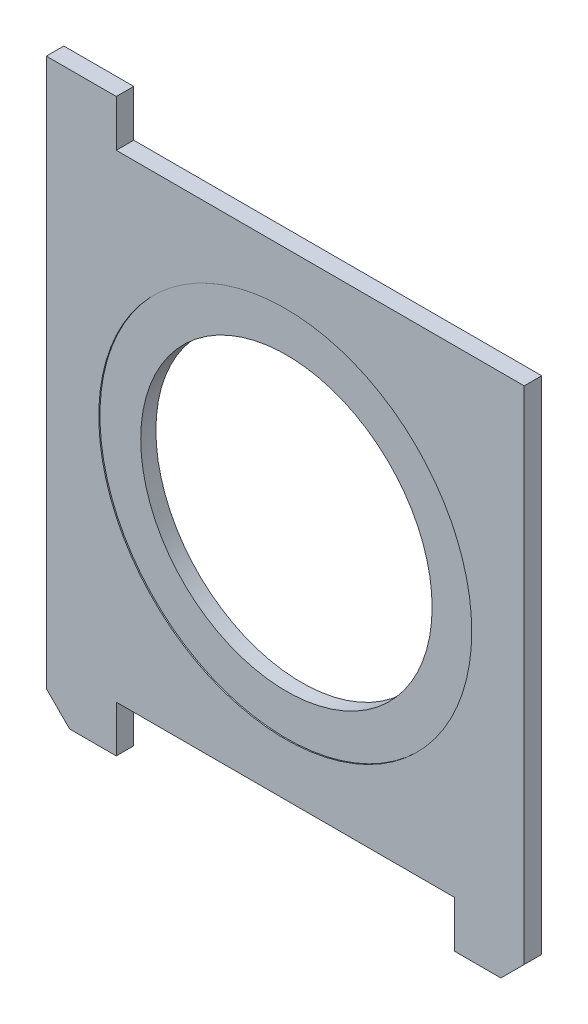
ISO-10303-21;
HEADER;
FILE_DESCRIPTION(('STEP AP214'),'2;1');
FILE_NAME('part.step','',(''),(''),'','','');
FILE_SCHEMA(('AUTOMOTIVE_DESIGN { 1 0 10303 214 1 1 1 1 }'));
ENDSEC;
DATA;
#1=APPLICATION_CONTEXT('core data for automotive mechanical design processes');
#2=APPLICATION_PROTOCOL_DEFINITION('international standard','automotive_design',2000,#1);
#3=PRODUCT_CONTEXT('',#1,'mechanical');
#4=PRODUCT('Part','Part','',(#3));
#5=PRODUCT_RELATED_PRODUCT_CATEGORY('part','',(#4));
#6=PRODUCT_DEFINITION_FORMATION('','',#4);
#7=PRODUCT_DEFINITION_CONTEXT('part definition',#1,'design');
#8=PRODUCT_DEFINITION('design','',#6,#7);
#9=PRODUCT_DEFINITION_SHAPE('','',#8);
#10=(LENGTH_UNIT() NAMED_UNIT(*) SI_UNIT(.MILLI.,.METRE.));
#11=(NAMED_UNIT(*) PLANE_ANGLE_UNIT() SI_UNIT($,.RADIAN.));
#12=(NAMED_UNIT(*) SI_UNIT($,.STERADIAN.) SOLID_ANGLE_UNIT());
#13=UNCERTAINTY_MEASURE_WITH_UNIT(LENGTH_MEASURE(1.E-05),#10,'distance_accuracy_value','');
#14=(GEOMETRIC_REPRESENTATION_CONTEXT(3) GLOBAL_UNCERTAINTY_ASSIGNED_CONTEXT((#13)) GLOBAL_UNIT_ASSIGNED_CONTEXT((#10,
#11,#12)) REPRESENTATION_CONTEXT('',''));
#15=CARTESIAN_POINT('',(0.,0.,0.));
#16=DIRECTION('',(0.,0.,1.));
#17=DIRECTION('',(1.,0.,0.));
#18=AXIS2_PLACEMENT_3D('',#15,#16,#17);
#19=CARTESIAN_POINT('',(0.,0.,1.5));
#20=DIRECTION('',(0.,0.,-1.));
#21=DIRECTION('',(-1.,0.,0.));
#22=AXIS2_PLACEMENT_3D('',#19,#20,#21);
#23=CYLINDRICAL_SURFACE('',#22,12.5);
#24=CARTESIAN_POINT('',(0.,0.,0.1));
#25=DIRECTION('',(0.,0.,-1.));
#26=DIRECTION('',(-1.,0.,0.));
#27=AXIS2_PLACEMENT_3D('',#24,#25,#26);
#28=CIRCLE('',#27,12.5);
#29=CARTESIAN_POINT('',(-12.5,0.,0.1));
#30=VERTEX_POINT('',#29);
#31=EDGE_CURVE('E151',#30,#30,#28,.F.);
#32=ORIENTED_EDGE('',*,*,#31,.F.);
#33=EDGE_LOOP('',(#32));
#34=FACE_BOUND('',#33,.T.);
#35=CARTESIAN_POINT('',(0.,0.,1.4));
#36=DIRECTION('',(0.,0.,1.));
#37=DIRECTION('',(1.,0.,0.));
#38=AXIS2_PLACEMENT_3D('',#35,#36,#37);
#39=CIRCLE('',#38,12.5);
#40=CARTESIAN_POINT('',(12.5,0.,1.4));
#41=VERTEX_POINT('',#40);
#42=EDGE_CURVE('E212',#41,#41,#39,.F.);
#43=ORIENTED_EDGE('',*,*,#42,.F.);
#44=EDGE_LOOP('',(#43));
#45=FACE_BOUND('',#44,.T.);
#46=ADVANCED_FACE('F36',(#34,#45),#23,.F.);
#47=CARTESIAN_POINT('',(-20.5,-20.5,1.5));
#48=DIRECTION('',(0.,1.,0.));
#49=DIRECTION('',(0.,0.,1.));
#50=AXIS2_PLACEMENT_3D('',#47,#48,#49);
#51=PLANE('',#50);
#52=DIRECTION('',(1.,0.,0.));
#53=VECTOR('',#52,1.);
#54=CARTESIAN_POINT('',(-20.5,-20.5,1.5));
#55=LINE('',#54,#53);
#56=CARTESIAN_POINT('',(-14.5,-20.5,1.5));
#57=VERTEX_POINT('',#56);
#58=CARTESIAN_POINT('',(14.5,-20.5,1.5));
#59=VERTEX_POINT('',#58);
#60=EDGE_CURVE('E142',#57,#59,#55,.T.);
#61=ORIENTED_EDGE('',*,*,#60,.F.);
#62=DIRECTION('',(0.,0.,-1.));
#63=VECTOR('',#62,1.);
#64=CARTESIAN_POINT('',(-14.5,-20.5,8.71110255092798));
#65=LINE('',#64,#63);
#66=CARTESIAN_POINT('',(-14.5,-20.5,0.));
#67=VERTEX_POINT('',#66);
#68=EDGE_CURVE('E140',#57,#67,#65,.T.);
#69=ORIENTED_EDGE('',*,*,#68,.T.);
#70=DIRECTION('',(1.,0.,0.));
#71=VECTOR('',#70,1.);
#72=CARTESIAN_POINT('',(-20.5,-20.5,0.));
#73=LINE('',#72,#71);
#74=CARTESIAN_POINT('',(14.5,-20.5,0.));
#75=VERTEX_POINT('',#74);
#76=EDGE_CURVE('E124',#67,#75,#73,.T.);
#77=ORIENTED_EDGE('',*,*,#76,.T.);
#78=DIRECTION('',(0.,0.,-1.));
#79=VECTOR('',#78,1.);
#80=CARTESIAN_POINT('',(14.5,-20.5,8.71110255092798));
#81=LINE('',#80,#79);
#82=EDGE_CURVE('E166',#59,#75,#81,.T.);
#83=ORIENTED_EDGE('',*,*,#82,.F.);
#84=EDGE_LOOP('',(#61,#69,#77,#83));
#85=FACE_BOUND('',#84,.T.);
#86=ADVANCED_FACE('F141',(#85),#51,.F.);
#87=CARTESIAN_POINT('',(-20.5,20.5,1.5));
#88=DIRECTION('',(0.,-1.,0.));
#89=DIRECTION('',(0.,0.,-1.));
#90=AXIS2_PLACEMENT_3D('',#87,#88,#89);
#91=PLANE('',#90);
#92=DIRECTION('',(0.,0.,-1.));
#93=VECTOR('',#92,1.);
#94=CARTESIAN_POINT('',(-14.5,20.5,8.71110255092798));
#95=LINE('',#94,#93);
#96=CARTESIAN_POINT('',(-14.5,20.5,1.5));
#97=VERTEX_POINT('',#96);
#98=CARTESIAN_POINT('',(-14.5,20.5,0.));
#99=VERTEX_POINT('',#98);
#100=EDGE_CURVE('E179',#97,#99,#95,.T.);
#101=ORIENTED_EDGE('',*,*,#100,.F.);
#102=DIRECTION('',(-1.,0.,0.));
#103=VECTOR('',#102,1.);
#104=CARTESIAN_POINT('',(-20.5,20.5,1.5));
#105=LINE('',#104,#103);
#106=CARTESIAN_POINT('',(20.5,20.5,1.5));
#107=VERTEX_POINT('',#106);
#108=EDGE_CURVE('E196',#107,#97,#105,.T.);
#109=ORIENTED_EDGE('',*,*,#108,.F.);
#110=DIRECTION('',(0.,0.,-1.));
#111=VECTOR('',#110,1.);
#112=CARTESIAN_POINT('',(20.5,20.5,1.5));
#113=LINE('',#112,#111);
#114=CARTESIAN_POINT('',(20.5,20.5,0.));
#115=VERTEX_POINT('',#114);
#116=EDGE_CURVE('E203',#107,#115,#113,.T.);
#117=ORIENTED_EDGE('',*,*,#116,.T.);
#118=DIRECTION('',(-1.,0.,0.));
#119=VECTOR('',#118,1.);
#120=CARTESIAN_POINT('',(-20.5,20.5,0.));
#121=LINE('',#120,#119);
#122=EDGE_CURVE('E205',#115,#99,#121,.T.);
#123=ORIENTED_EDGE('',*,*,#122,.T.);
#124=EDGE_LOOP('',(#101,#109,#117,#123));
#125=FACE_BOUND('',#124,.T.);
#126=ADVANCED_FACE('F239',(#125),#91,.F.);
#127=CARTESIAN_POINT('',(20.5,-20.5,1.5));
#128=DIRECTION('',(-1.,0.,0.));
#129=DIRECTION('',(0.,0.,1.));
#130=AXIS2_PLACEMENT_3D('',#127,#128,#129);
#131=PLANE('',#130);
#132=DIRECTION('',(0.,1.,0.));
#133=VECTOR('',#132,1.);
#134=CARTESIAN_POINT('',(20.5,-20.5,1.5));
#135=LINE('',#134,#133);
#136=CARTESIAN_POINT('',(20.5,-22.5,1.5));
#137=VERTEX_POINT('',#136);
#138=EDGE_CURVE('E136',#137,#107,#135,.T.);
#139=ORIENTED_EDGE('',*,*,#138,.F.);
#140=DIRECTION('',(0.,0.,-1.));
#141=VECTOR('',#140,1.);
#142=CARTESIAN_POINT('',(20.5,-22.5,0.));
#143=LINE('',#142,#141);
#144=CARTESIAN_POINT('',(20.5,-22.5,0.));
#145=VERTEX_POINT('',#144);
#146=EDGE_CURVE('E225',#137,#145,#143,.T.);
#147=ORIENTED_EDGE('',*,*,#146,.T.);
#148=DIRECTION('',(0.,1.,0.));
#149=VECTOR('',#148,1.);
#150=CARTESIAN_POINT('',(20.5,-20.5,0.));
#151=LINE('',#150,#149);
#152=EDGE_CURVE('E194',#145,#115,#151,.T.);
#153=ORIENTED_EDGE('',*,*,#152,.T.);
#154=ORIENTED_EDGE('',*,*,#116,.F.);
#155=EDGE_LOOP('',(#139,#147,#153,#154));
#156=FACE_BOUND('',#155,.T.);
#157=ADVANCED_FACE('F231',(#156),#131,.F.);
#158=CARTESIAN_POINT('',(-20.5,-20.5,1.5));
#159=DIRECTION('',(1.,0.,0.));
#160=DIRECTION('',(0.,0.,-1.));
#161=AXIS2_PLACEMENT_3D('',#158,#159,#160);
#162=PLANE('',#161);
#163=DIRECTION('',(0.,-1.,0.));
#164=VECTOR('',#163,1.);
#165=CARTESIAN_POINT('',(-20.5,-20.5,0.));
#166=LINE('',#165,#164);
#167=CARTESIAN_POINT('',(-20.5,24.5,0.));
#168=VERTEX_POINT('',#167);
#169=CARTESIAN_POINT('',(-20.5,-22.5,0.));
#170=VERTEX_POINT('',#169);
#171=EDGE_CURVE('E137',#168,#170,#166,.T.);
#172=ORIENTED_EDGE('',*,*,#171,.T.);
#173=DIRECTION('',(0.,0.,1.));
#174=VECTOR('',#173,1.);
#175=CARTESIAN_POINT('',(-20.5,-22.5,1.5));
#176=LINE('',#175,#174);
#177=CARTESIAN_POINT('',(-20.5,-22.5,1.5));
#178=VERTEX_POINT('',#177);
#179=EDGE_CURVE('E221',#170,#178,#176,.T.);
#180=ORIENTED_EDGE('',*,*,#179,.T.);
#181=DIRECTION('',(0.,-1.,0.));
#182=VECTOR('',#181,1.);
#183=CARTESIAN_POINT('',(-20.5,-20.5,1.5));
#184=LINE('',#183,#182);
#185=CARTESIAN_POINT('',(-20.5,24.5,1.5));
#186=VERTEX_POINT('',#185);
#187=EDGE_CURVE('E199',#186,#178,#184,.T.);
#188=ORIENTED_EDGE('',*,*,#187,.F.);
#189=DIRECTION('',(0.,0.,-1.));
#190=VECTOR('',#189,1.);
#191=CARTESIAN_POINT('',(-20.5,24.5,8.71110255092798));
#192=LINE('',#191,#190);
#193=EDGE_CURVE('E185',#186,#168,#192,.T.);
#194=ORIENTED_EDGE('',*,*,#193,.T.);
#195=EDGE_LOOP('',(#172,#180,#188,#194));
#196=FACE_BOUND('',#195,.T.);
#197=ADVANCED_FACE('F260',(#196),#162,.F.);
#198=CARTESIAN_POINT('',(0.,0.,1.5));
#199=DIRECTION('',(0.,0.,-1.));
#200=DIRECTION('',(-1.,0.,0.));
#201=AXIS2_PLACEMENT_3D('',#198,#199,#200);
#202=PLANE('',#201);
#203=CARTESIAN_POINT('',(0.,0.,1.5));
#204=DIRECTION('',(0.,0.,1.));
#205=DIRECTION('',(1.,0.,0.));
#206=AXIS2_PLACEMENT_3D('',#203,#204,#205);
#207=CIRCLE('',#206,16.);
#208=CARTESIAN_POINT('',(16.,0.,1.5));
#209=VERTEX_POINT('',#208);
#210=EDGE_CURVE('E485',#209,#209,#207,.T.);
#211=ORIENTED_EDGE('',*,*,#210,.F.);
#212=EDGE_LOOP('',(#211));
#213=FACE_BOUND('',#212,.T.);
#214=DIRECTION('',(1.,0.,0.));
#215=VECTOR('',#214,1.);
#216=CARTESIAN_POINT('',(20.5,-24.5,1.5));
#217=LINE('',#216,#215);
#218=CARTESIAN_POINT('',(14.5,-24.5,1.5));
#219=VERTEX_POINT('',#218);
#220=CARTESIAN_POINT('',(18.5,-24.5,1.5));
#221=VERTEX_POINT('',#220);
#222=EDGE_CURVE('E165',#219,#221,#217,.T.);
#223=ORIENTED_EDGE('',*,*,#222,.T.);
#224=DIRECTION('',(0.707106781186549,0.707106781186546,0.));
#225=VECTOR('',#224,1.);
#226=CARTESIAN_POINT('',(20.5,-22.5,1.5));
#227=LINE('',#226,#225);
#228=EDGE_CURVE('E11',#221,#137,#227,.T.);
#229=ORIENTED_EDGE('',*,*,#228,.T.);
#230=ORIENTED_EDGE('',*,*,#138,.T.);
#231=ORIENTED_EDGE('',*,*,#108,.T.);
#232=DIRECTION('',(0.,1.,0.));
#233=VECTOR('',#232,1.);
#234=CARTESIAN_POINT('',(-14.5,20.5,1.5));
#235=LINE('',#234,#233);
#236=CARTESIAN_POINT('',(-14.5,24.5,1.5));
#237=VERTEX_POINT('',#236);
#238=EDGE_CURVE('E176',#97,#237,#235,.T.);
#239=ORIENTED_EDGE('',*,*,#238,.T.);
#240=DIRECTION('',(-1.,0.,0.));
#241=VECTOR('',#240,1.);
#242=CARTESIAN_POINT('',(-20.5,24.5,1.5));
#243=LINE('',#242,#241);
#244=EDGE_CURVE('E178',#237,#186,#243,.T.);
#245=ORIENTED_EDGE('',*,*,#244,.T.);
#246=ORIENTED_EDGE('',*,*,#187,.T.);
#247=DIRECTION('',(0.707106781186546,-0.707106781186549,0.));
#248=VECTOR('',#247,1.);
#249=CARTESIAN_POINT('',(-18.5,-24.5,1.5));
#250=LINE('',#249,#248);
#251=CARTESIAN_POINT('',(-18.5,-24.5,1.5));
#252=VERTEX_POINT('',#251);
#253=EDGE_CURVE('E223',#178,#252,#250,.T.);
#254=ORIENTED_EDGE('',*,*,#253,.T.);
#255=DIRECTION('',(1.,0.,0.));
#256=VECTOR('',#255,1.);
#257=CARTESIAN_POINT('',(-20.5,-24.5,1.5));
#258=LINE('',#257,#256);
#259=CARTESIAN_POINT('',(-14.5,-24.5,1.5));
#260=VERTEX_POINT('',#259);
#261=EDGE_CURVE('E158',#252,#260,#258,.T.);
#262=ORIENTED_EDGE('',*,*,#261,.T.);
#263=DIRECTION('',(0.,1.,0.));
#264=VECTOR('',#263,1.);
#265=CARTESIAN_POINT('',(-14.5,-20.5,1.5));
#266=LINE('',#265,#264);
#267=EDGE_CURVE('E161',#260,#57,#266,.T.);
#268=ORIENTED_EDGE('',*,*,#267,.T.);
#269=ORIENTED_EDGE('',*,*,#60,.T.);
#270=DIRECTION('',(0.,-1.,0.));
#271=VECTOR('',#270,1.);
#272=CARTESIAN_POINT('',(14.5,-20.5,1.5));
#273=LINE('',#272,#271);
#274=EDGE_CURVE('E163',#59,#219,#273,.T.);
#275=ORIENTED_EDGE('',*,*,#274,.T.);
#276=EDGE_LOOP('',(#223,#229,#230,#231,#239,#245,#246,#254,#262,#268,#269,#275));
#277=FACE_BOUND('',#276,.T.);
#278=ADVANCED_FACE('F242',(#213,#277),#202,.F.);
#279=CARTESIAN_POINT('',(0.,0.,0.));
#280=DIRECTION('',(0.,0.,-1.));
#281=DIRECTION('',(-1.,0.,0.));
#282=AXIS2_PLACEMENT_3D('',#279,#280,#281);
#283=PLANE('',#282);
#284=CARTESIAN_POINT('',(0.,0.,0.));
#285=DIRECTION('',(0.,0.,-1.));
#286=DIRECTION('',(-1.,0.,0.));
#287=AXIS2_PLACEMENT_3D('',#284,#285,#286);
#288=CIRCLE('',#287,16.);
#289=CARTESIAN_POINT('',(-16.,0.,0.));
#290=VERTEX_POINT('',#289);
#291=EDGE_CURVE('E215',#290,#290,#288,.T.);
#292=ORIENTED_EDGE('',*,*,#291,.F.);
#293=EDGE_LOOP('',(#292));
#294=FACE_BOUND('',#293,.T.);
#295=ORIENTED_EDGE('',*,*,#152,.F.);
#296=DIRECTION('',(-0.707106781186549,-0.707106781186546,0.));
#297=VECTOR('',#296,1.);
#298=CARTESIAN_POINT('',(21.5,-21.5,0.));
#299=LINE('',#298,#297);
#300=CARTESIAN_POINT('',(18.5,-24.5,0.));
#301=VERTEX_POINT('',#300);
#302=EDGE_CURVE('E59',#145,#301,#299,.T.);
#303=ORIENTED_EDGE('',*,*,#302,.T.);
#304=DIRECTION('',(-1.,0.,0.));
#305=VECTOR('',#304,1.);
#306=CARTESIAN_POINT('',(20.5,-24.5,0.));
#307=LINE('',#306,#305);
#308=CARTESIAN_POINT('',(14.5,-24.5,0.));
#309=VERTEX_POINT('',#308);
#310=EDGE_CURVE('E167',#301,#309,#307,.T.);
#311=ORIENTED_EDGE('',*,*,#310,.T.);
#312=DIRECTION('',(0.,1.,0.));
#313=VECTOR('',#312,1.);
#314=CARTESIAN_POINT('',(14.5,-20.5,0.));
#315=LINE('',#314,#313);
#316=EDGE_CURVE('E132',#309,#75,#315,.T.);
#317=ORIENTED_EDGE('',*,*,#316,.T.);
#318=ORIENTED_EDGE('',*,*,#76,.F.);
#319=DIRECTION('',(0.,-1.,0.));
#320=VECTOR('',#319,1.);
#321=CARTESIAN_POINT('',(-14.5,-20.5,0.));
#322=LINE('',#321,#320);
#323=CARTESIAN_POINT('',(-14.5,-24.5,0.));
#324=VERTEX_POINT('',#323);
#325=EDGE_CURVE('E129',#67,#324,#322,.T.);
#326=ORIENTED_EDGE('',*,*,#325,.T.);
#327=DIRECTION('',(-1.,0.,0.));
#328=VECTOR('',#327,1.);
#329=CARTESIAN_POINT('',(-20.5,-24.5,0.));
#330=LINE('',#329,#328);
#331=CARTESIAN_POINT('',(-18.5,-24.5,0.));
#332=VERTEX_POINT('',#331);
#333=EDGE_CURVE('E147',#324,#332,#330,.T.);
#334=ORIENTED_EDGE('',*,*,#333,.T.);
#335=DIRECTION('',(-0.707106781186546,0.707106781186549,0.));
#336=VECTOR('',#335,1.);
#337=CARTESIAN_POINT('',(-21.5,-21.5,0.));
#338=LINE('',#337,#336);
#339=EDGE_CURVE('E219',#332,#170,#338,.T.);
#340=ORIENTED_EDGE('',*,*,#339,.T.);
#341=ORIENTED_EDGE('',*,*,#171,.F.);
#342=DIRECTION('',(1.,0.,0.));
#343=VECTOR('',#342,1.);
#344=CARTESIAN_POINT('',(-20.5,24.5,0.));
#345=LINE('',#344,#343);
#346=CARTESIAN_POINT('',(-14.5,24.5,0.));
#347=VERTEX_POINT('',#346);
#348=EDGE_CURVE('E175',#168,#347,#345,.T.);
#349=ORIENTED_EDGE('',*,*,#348,.T.);
#350=DIRECTION('',(0.,-1.,0.));
#351=VECTOR('',#350,1.);
#352=CARTESIAN_POINT('',(-14.5,20.5,0.));
#353=LINE('',#352,#351);
#354=EDGE_CURVE('E182',#347,#99,#353,.T.);
#355=ORIENTED_EDGE('',*,*,#354,.T.);
#356=ORIENTED_EDGE('',*,*,#122,.F.);
#357=EDGE_LOOP('',(#295,#303,#311,#317,#318,#326,#334,#340,#341,#349,#355,#356));
#358=FACE_BOUND('',#357,.T.);
#359=ADVANCED_FACE('F126',(#294,#358),#283,.T.);
#360=CARTESIAN_POINT('',(-14.5,20.5,8.71110255092798));
#361=DIRECTION('',(1.,0.,0.));
#362=DIRECTION('',(0.,1.,0.));
#363=AXIS2_PLACEMENT_3D('',#360,#361,#362);
#364=PLANE('',#363);
#365=ORIENTED_EDGE('',*,*,#238,.F.);
#366=ORIENTED_EDGE('',*,*,#100,.T.);
#367=ORIENTED_EDGE('',*,*,#354,.F.);
#368=DIRECTION('',(0.,0.,-1.));
#369=VECTOR('',#368,1.);
#370=CARTESIAN_POINT('',(-14.5,24.5,8.71110255092798));
#371=LINE('',#370,#369);
#372=EDGE_CURVE('E188',#237,#347,#371,.T.);
#373=ORIENTED_EDGE('',*,*,#372,.F.);
#374=EDGE_LOOP('',(#365,#366,#367,#373));
#375=FACE_BOUND('',#374,.T.);
#376=ADVANCED_FACE('F245',(#375),#364,.T.);
#377=CARTESIAN_POINT('',(-20.5,24.5,8.71110255092798));
#378=DIRECTION('',(0.,1.,0.));
#379=DIRECTION('',(0.,0.,1.));
#380=AXIS2_PLACEMENT_3D('',#377,#378,#379);
#381=PLANE('',#380);
#382=ORIENTED_EDGE('',*,*,#244,.F.);
#383=ORIENTED_EDGE('',*,*,#372,.T.);
#384=ORIENTED_EDGE('',*,*,#348,.F.);
#385=ORIENTED_EDGE('',*,*,#193,.F.);
#386=EDGE_LOOP('',(#382,#383,#384,#385));
#387=FACE_BOUND('',#386,.T.);
#388=ADVANCED_FACE('F250',(#387),#381,.T.);
#389=CARTESIAN_POINT('',(14.5,-20.5,8.71110255092798));
#390=DIRECTION('',(-1.,0.,0.));
#391=DIRECTION('',(0.,-1.,0.));
#392=AXIS2_PLACEMENT_3D('',#389,#390,#391);
#393=PLANE('',#392);
#394=ORIENTED_EDGE('',*,*,#274,.F.);
#395=ORIENTED_EDGE('',*,*,#82,.T.);
#396=ORIENTED_EDGE('',*,*,#316,.F.);
#397=DIRECTION('',(0.,0.,-1.));
#398=VECTOR('',#397,1.);
#399=CARTESIAN_POINT('',(14.5,-24.5,8.71110255092798));
#400=LINE('',#399,#398);
#401=EDGE_CURVE('E170',#219,#309,#400,.T.);
#402=ORIENTED_EDGE('',*,*,#401,.F.);
#403=EDGE_LOOP('',(#394,#395,#396,#402));
#404=FACE_BOUND('',#403,.T.);
#405=ADVANCED_FACE('F290',(#404),#393,.T.);
#406=CARTESIAN_POINT('',(20.5,-24.5,8.71110255092798));
#407=DIRECTION('',(0.,-1.,0.));
#408=DIRECTION('',(0.,0.,-1.));
#409=AXIS2_PLACEMENT_3D('',#406,#407,#408);
#410=PLANE('',#409);
#411=ORIENTED_EDGE('',*,*,#310,.F.);
#412=DIRECTION('',(0.,0.,1.));
#413=VECTOR('',#412,1.);
#414=CARTESIAN_POINT('',(18.5,-24.5,1.5));
#415=LINE('',#414,#413);
#416=EDGE_CURVE('E45',#301,#221,#415,.T.);
#417=ORIENTED_EDGE('',*,*,#416,.T.);
#418=ORIENTED_EDGE('',*,*,#222,.F.);
#419=ORIENTED_EDGE('',*,*,#401,.T.);
#420=EDGE_LOOP('',(#411,#417,#418,#419));
#421=FACE_BOUND('',#420,.T.);
#422=ADVANCED_FACE('F286',(#421),#410,.T.);
#423=CARTESIAN_POINT('',(-20.5,-24.5,8.71110255092798));
#424=DIRECTION('',(0.,-1.,0.));
#425=DIRECTION('',(0.,0.,-1.));
#426=AXIS2_PLACEMENT_3D('',#423,#424,#425);
#427=PLANE('',#426);
#428=ORIENTED_EDGE('',*,*,#261,.F.);
#429=DIRECTION('',(0.,0.,-1.));
#430=VECTOR('',#429,1.);
#431=CARTESIAN_POINT('',(-18.5,-24.5,0.));
#432=LINE('',#431,#430);
#433=EDGE_CURVE('E210',#252,#332,#432,.T.);
#434=ORIENTED_EDGE('',*,*,#433,.T.);
#435=ORIENTED_EDGE('',*,*,#333,.F.);
#436=DIRECTION('',(0.,0.,-1.));
#437=VECTOR('',#436,1.);
#438=CARTESIAN_POINT('',(-14.5,-24.5,8.71110255092798));
#439=LINE('',#438,#437);
#440=EDGE_CURVE('E146',#260,#324,#439,.T.);
#441=ORIENTED_EDGE('',*,*,#440,.F.);
#442=EDGE_LOOP('',(#428,#434,#435,#441));
#443=FACE_BOUND('',#442,.T.);
#444=ADVANCED_FACE('F259',(#443),#427,.T.);
#445=CARTESIAN_POINT('',(-14.5,-20.5,8.71110255092798));
#446=DIRECTION('',(1.,0.,0.));
#447=DIRECTION('',(0.,1.,0.));
#448=AXIS2_PLACEMENT_3D('',#445,#446,#447);
#449=PLANE('',#448);
#450=ORIENTED_EDGE('',*,*,#267,.F.);
#451=ORIENTED_EDGE('',*,*,#440,.T.);
#452=ORIENTED_EDGE('',*,*,#325,.F.);
#453=ORIENTED_EDGE('',*,*,#68,.F.);
#454=EDGE_LOOP('',(#450,#451,#452,#453));
#455=FACE_BOUND('',#454,.T.);
#456=ADVANCED_FACE('F149',(#455),#449,.T.);
#457=CARTESIAN_POINT('',(0.,0.,0.1));
#458=DIRECTION('',(0.,0.,-1.));
#459=DIRECTION('',(-1.,0.,0.));
#460=AXIS2_PLACEMENT_3D('',#457,#458,#459);
#461=PLANE('',#460);
#462=CARTESIAN_POINT('',(0.,0.,0.1));
#463=DIRECTION('',(0.,0.,-1.));
#464=DIRECTION('',(-1.,0.,0.));
#465=AXIS2_PLACEMENT_3D('',#462,#463,#464);
#466=CIRCLE('',#465,16.);
#467=CARTESIAN_POINT('',(-16.,0.,0.1));
#468=VERTEX_POINT('',#467);
#469=EDGE_CURVE('E155',#468,#468,#466,.T.);
#470=ORIENTED_EDGE('',*,*,#469,.T.);
#471=EDGE_LOOP('',(#470));
#472=FACE_BOUND('',#471,.T.);
#473=ORIENTED_EDGE('',*,*,#31,.T.);
#474=EDGE_LOOP('',(#473));
#475=FACE_BOUND('',#474,.T.);
#476=ADVANCED_FACE('F289',(#472,#475),#461,.T.);
#477=CARTESIAN_POINT('',(0.,0.,0.1));
#478=DIRECTION('',(0.,0.,-1.));
#479=DIRECTION('',(-1.,0.,0.));
#480=AXIS2_PLACEMENT_3D('',#477,#478,#479);
#481=CYLINDRICAL_SURFACE('',#480,16.);
#482=ORIENTED_EDGE('',*,*,#469,.F.);
#483=EDGE_LOOP('',(#482));
#484=FACE_BOUND('',#483,.T.);
#485=ORIENTED_EDGE('',*,*,#291,.T.);
#486=EDGE_LOOP('',(#485));
#487=FACE_BOUND('',#486,.T.);
#488=ADVANCED_FACE('F282',(#484,#487),#481,.F.);
#489=CARTESIAN_POINT('',(0.,0.,1.4));
#490=DIRECTION('',(0.,0.,1.));
#491=DIRECTION('',(1.,0.,0.));
#492=AXIS2_PLACEMENT_3D('',#489,#490,#491);
#493=PLANE('',#492);
#494=CARTESIAN_POINT('',(0.,0.,1.4));
#495=DIRECTION('',(0.,0.,1.));
#496=DIRECTION('',(1.,0.,0.));
#497=AXIS2_PLACEMENT_3D('',#494,#495,#496);
#498=CIRCLE('',#497,16.);
#499=CARTESIAN_POINT('',(16.,0.,1.4));
#500=VERTEX_POINT('',#499);
#501=EDGE_CURVE('E216',#500,#500,#498,.T.);
#502=ORIENTED_EDGE('',*,*,#501,.T.);
#503=EDGE_LOOP('',(#502));
#504=FACE_BOUND('',#503,.T.);
#505=ORIENTED_EDGE('',*,*,#42,.T.);
#506=EDGE_LOOP('',(#505));
#507=FACE_BOUND('',#506,.T.);
#508=ADVANCED_FACE('F321',(#504,#507),#493,.T.);
#509=CARTESIAN_POINT('',(0.,0.,1.4));
#510=DIRECTION('',(0.,0.,1.));
#511=DIRECTION('',(1.,0.,0.));
#512=AXIS2_PLACEMENT_3D('',#509,#510,#511);
#513=CYLINDRICAL_SURFACE('',#512,16.);
#514=ORIENTED_EDGE('',*,*,#501,.F.);
#515=EDGE_LOOP('',(#514));
#516=FACE_BOUND('',#515,.T.);
#517=ORIENTED_EDGE('',*,*,#210,.T.);
#518=EDGE_LOOP('',(#517));
#519=FACE_BOUND('',#518,.T.);
#520=ADVANCED_FACE('F317',(#516,#519),#513,.F.);
#521=CARTESIAN_POINT('',(-18.5,-24.5,8.71110255092798));
#522=DIRECTION('',(-0.707106781186549,-0.707106781186546,0.));
#523=DIRECTION('',(0.,0.,1.));
#524=AXIS2_PLACEMENT_3D('',#521,#522,#523);
#525=PLANE('',#524);
#526=ORIENTED_EDGE('',*,*,#253,.F.);
#527=ORIENTED_EDGE('',*,*,#179,.F.);
#528=ORIENTED_EDGE('',*,*,#339,.F.);
#529=ORIENTED_EDGE('',*,*,#433,.F.);
#530=EDGE_LOOP('',(#526,#527,#528,#529));
#531=FACE_BOUND('',#530,.T.);
#532=ADVANCED_FACE('F257',(#531),#525,.T.);
#533=CARTESIAN_POINT('',(20.5,-22.5,1.5));
#534=DIRECTION('',(0.707106781186546,-0.707106781186549,0.));
#535=DIRECTION('',(0.,0.,1.));
#536=AXIS2_PLACEMENT_3D('',#533,#534,#535);
#537=PLANE('',#536);
#538=ORIENTED_EDGE('',*,*,#228,.F.);
#539=ORIENTED_EDGE('',*,*,#416,.F.);
#540=ORIENTED_EDGE('',*,*,#302,.F.);
#541=ORIENTED_EDGE('',*,*,#146,.F.);
#542=EDGE_LOOP('',(#538,#539,#540,#541));
#543=FACE_BOUND('',#542,.T.);
#544=ADVANCED_FACE('F39',(#543),#537,.T.);
#545=CLOSED_SHELL('',(#46,#86,#126,#157,#197,#278,#359,#376,#388,#405,#422,#444,#456,#476,#488,
#508,#520,#532,#544));
#546=MANIFOLD_SOLID_BREP('B2',#545);
#547=ADVANCED_BREP_SHAPE_REPRESENTATION('',(#18,#546),#14);
#548=SHAPE_DEFINITION_REPRESENTATION(#9,#547);
ENDSEC;
END-ISO-10303-21;
